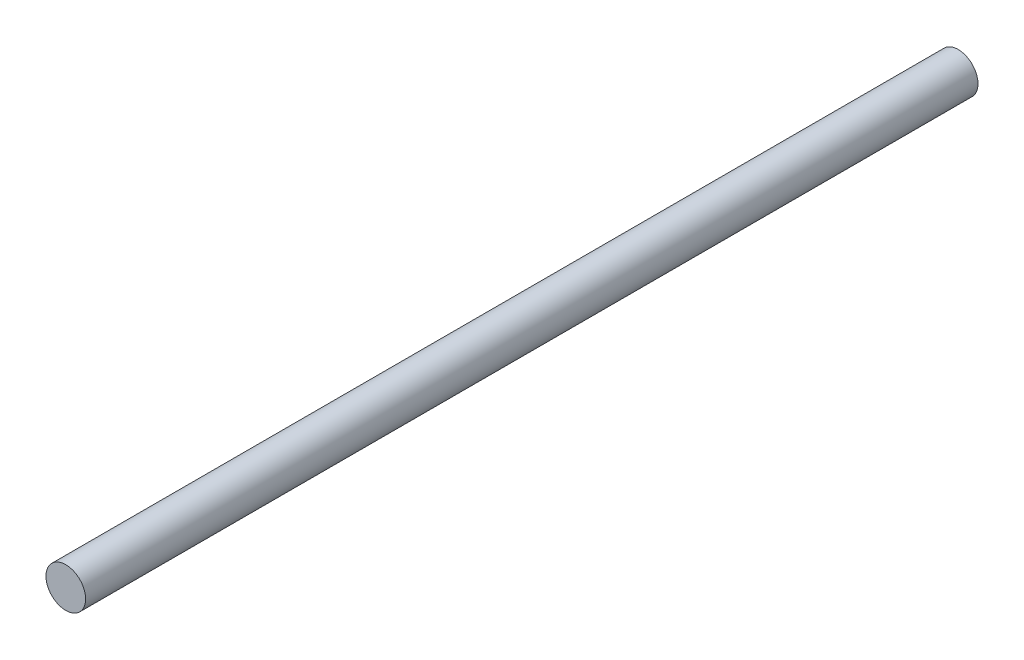
ISO-10303-21;
HEADER;
FILE_DESCRIPTION(('STEP AP214'),'2;1');
FILE_NAME('part.step','',(''),(''),'','','');
FILE_SCHEMA(('AUTOMOTIVE_DESIGN { 1 0 10303 214 1 1 1 1 }'));
ENDSEC;
DATA;
#1=APPLICATION_CONTEXT('core data for automotive mechanical design processes');
#2=APPLICATION_PROTOCOL_DEFINITION('international standard','automotive_design',2000,#1);
#3=PRODUCT_CONTEXT('',#1,'mechanical');
#4=PRODUCT('Part','Part','',(#3));
#5=PRODUCT_RELATED_PRODUCT_CATEGORY('part','',(#4));
#6=PRODUCT_DEFINITION_FORMATION('','',#4);
#7=PRODUCT_DEFINITION_CONTEXT('part definition',#1,'design');
#8=PRODUCT_DEFINITION('design','',#6,#7);
#9=PRODUCT_DEFINITION_SHAPE('','',#8);
#10=(LENGTH_UNIT() NAMED_UNIT(*) SI_UNIT(.MILLI.,.METRE.));
#11=(NAMED_UNIT(*) PLANE_ANGLE_UNIT() SI_UNIT($,.RADIAN.));
#12=(NAMED_UNIT(*) SI_UNIT($,.STERADIAN.) SOLID_ANGLE_UNIT());
#13=UNCERTAINTY_MEASURE_WITH_UNIT(LENGTH_MEASURE(1.E-05),#10,'distance_accuracy_value','');
#14=(GEOMETRIC_REPRESENTATION_CONTEXT(3) GLOBAL_UNCERTAINTY_ASSIGNED_CONTEXT((#13)) GLOBAL_UNIT_ASSIGNED_CONTEXT((#10,
#11,#12)) REPRESENTATION_CONTEXT('',''));
#15=CARTESIAN_POINT('',(0.,0.,0.));
#16=DIRECTION('',(0.,0.,1.));
#17=DIRECTION('',(1.,0.,0.));
#18=AXIS2_PLACEMENT_3D('',#15,#16,#17);
#19=CARTESIAN_POINT('',(0.,0.,180.));
#20=DIRECTION('',(0.,0.,-1.));
#21=DIRECTION('',(-1.,0.,0.));
#22=AXIS2_PLACEMENT_3D('',#19,#20,#21);
#23=CYLINDRICAL_SURFACE('',#22,4.);
#24=CARTESIAN_POINT('',(0.,0.,180.));
#25=DIRECTION('',(0.,0.,1.));
#26=DIRECTION('',(1.,0.,0.));
#27=AXIS2_PLACEMENT_3D('',#24,#25,#26);
#28=CIRCLE('',#27,4.);
#29=CARTESIAN_POINT('',(4.,0.,180.));
#30=VERTEX_POINT('',#29);
#31=EDGE_CURVE('E10',#30,#30,#28,.T.);
#32=ORIENTED_EDGE('',*,*,#31,.F.);
#33=EDGE_LOOP('',(#32));
#34=FACE_BOUND('',#33,.T.);
#35=CARTESIAN_POINT('',(0.,0.,0.));
#36=DIRECTION('',(0.,0.,1.));
#37=DIRECTION('',(1.,0.,0.));
#38=AXIS2_PLACEMENT_3D('',#35,#36,#37);
#39=CIRCLE('',#38,4.);
#40=CARTESIAN_POINT('',(4.,0.,0.));
#41=VERTEX_POINT('',#40);
#42=EDGE_CURVE('E40',#41,#41,#39,.T.);
#43=ORIENTED_EDGE('',*,*,#42,.T.);
#44=EDGE_LOOP('',(#43));
#45=FACE_BOUND('',#44,.T.);
#46=ADVANCED_FACE('F37',(#34,#45),#23,.T.);
#47=CARTESIAN_POINT('',(0.,0.,180.));
#48=DIRECTION('',(0.,0.,1.));
#49=DIRECTION('',(1.,0.,0.));
#50=AXIS2_PLACEMENT_3D('',#47,#48,#49);
#51=PLANE('',#50);
#52=ORIENTED_EDGE('',*,*,#31,.T.);
#53=EDGE_LOOP('',(#52));
#54=FACE_BOUND('',#53,.T.);
#55=ADVANCED_FACE('F54',(#54),#51,.T.);
#56=CARTESIAN_POINT('',(0.,0.,0.));
#57=DIRECTION('',(0.,0.,1.));
#58=DIRECTION('',(1.,0.,0.));
#59=AXIS2_PLACEMENT_3D('',#56,#57,#58);
#60=PLANE('',#59);
#61=ORIENTED_EDGE('',*,*,#42,.F.);
#62=EDGE_LOOP('',(#61));
#63=FACE_BOUND('',#62,.T.);
#64=ADVANCED_FACE('F52',(#63),#60,.F.);
#65=CLOSED_SHELL('',(#46,#55,#64));
#66=MANIFOLD_SOLID_BREP('B2',#65);
#67=ADVANCED_BREP_SHAPE_REPRESENTATION('',(#18,#66),#14);
#68=SHAPE_DEFINITION_REPRESENTATION(#9,#67);
ENDSEC;
END-ISO-10303-21;
